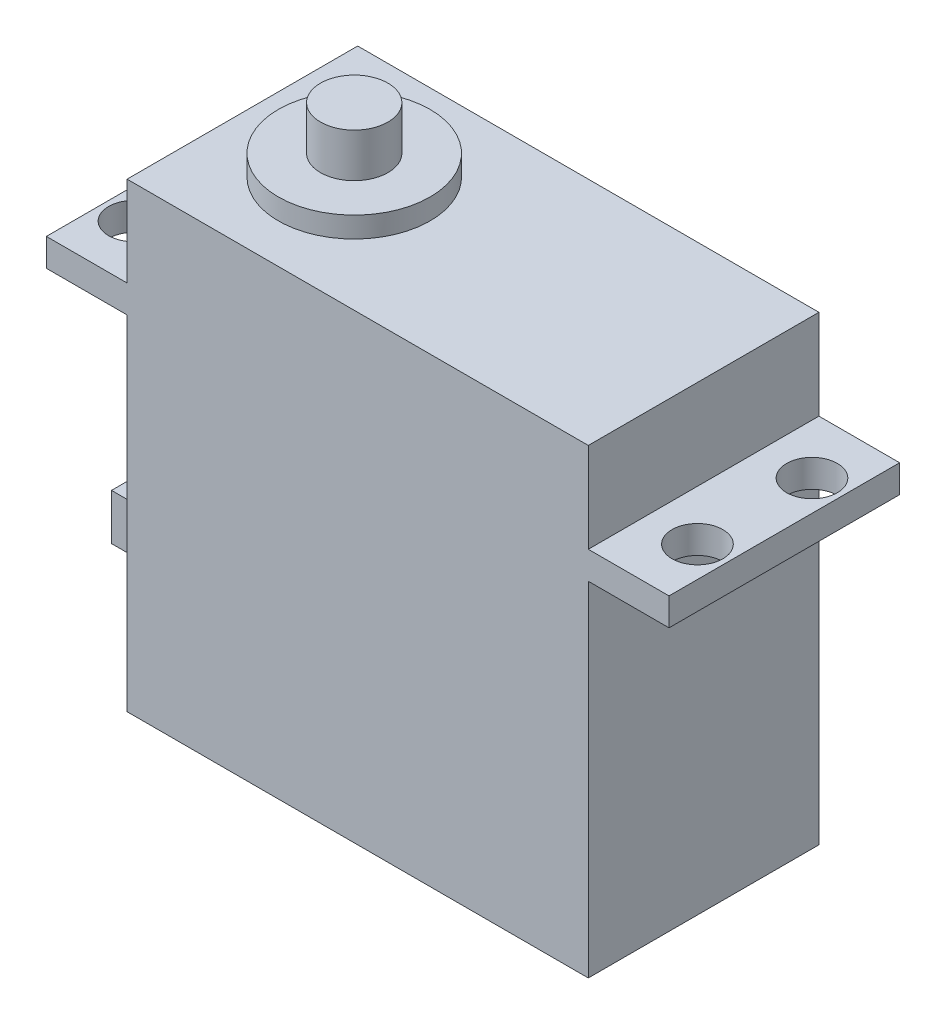
ISO-10303-21;
HEADER;
FILE_DESCRIPTION(('STEP AP214'),'2;1');
FILE_NAME('part.step','',(''),(''),'','','');
FILE_SCHEMA(('AUTOMOTIVE_DESIGN { 1 0 10303 214 1 1 1 1 }'));
ENDSEC;
DATA;
#1=APPLICATION_CONTEXT('core data for automotive mechanical design processes');
#2=APPLICATION_PROTOCOL_DEFINITION('international standard','automotive_design',2000,#1);
#3=PRODUCT_CONTEXT('',#1,'mechanical');
#4=PRODUCT('Part','Part','',(#3));
#5=PRODUCT_RELATED_PRODUCT_CATEGORY('part','',(#4));
#6=PRODUCT_DEFINITION_FORMATION('','',#4);
#7=PRODUCT_DEFINITION_CONTEXT('part definition',#1,'design');
#8=PRODUCT_DEFINITION('design','',#6,#7);
#9=PRODUCT_DEFINITION_SHAPE('','',#8);
#10=(LENGTH_UNIT() NAMED_UNIT(*) SI_UNIT(.MILLI.,.METRE.));
#11=(NAMED_UNIT(*) PLANE_ANGLE_UNIT() SI_UNIT($,.RADIAN.));
#12=(NAMED_UNIT(*) SI_UNIT($,.STERADIAN.) SOLID_ANGLE_UNIT());
#13=UNCERTAINTY_MEASURE_WITH_UNIT(LENGTH_MEASURE(1.E-05),#10,'distance_accuracy_value','');
#14=(GEOMETRIC_REPRESENTATION_CONTEXT(3) GLOBAL_UNCERTAINTY_ASSIGNED_CONTEXT((#13)) GLOBAL_UNIT_ASSIGNED_CONTEXT((#10,
#11,#12)) REPRESENTATION_CONTEXT('',''));
#15=CARTESIAN_POINT('',(0.,0.,0.));
#16=DIRECTION('',(0.,0.,1.));
#17=DIRECTION('',(1.,0.,0.));
#18=AXIS2_PLACEMENT_3D('',#15,#16,#17);
#19=CARTESIAN_POINT('',(-20.,-20.,20.));
#20=DIRECTION('',(1.,0.,0.));
#21=DIRECTION('',(0.,0.,-1.));
#22=AXIS2_PLACEMENT_3D('',#19,#20,#21);
#23=PLANE('',#22);
#24=DIRECTION('',(0.,-1.,0.));
#25=VECTOR('',#24,1.);
#26=CARTESIAN_POINT('',(-20.,-20.,20.));
#27=LINE('',#26,#25);
#28=CARTESIAN_POINT('',(-20.,9.8,20.));
#29=VERTEX_POINT('',#28);
#30=CARTESIAN_POINT('',(-20.,-20.,20.));
#31=VERTEX_POINT('',#30);
#32=EDGE_CURVE('E266',#29,#31,#27,.T.);
#33=ORIENTED_EDGE('',*,*,#32,.F.);
#34=DIRECTION('',(0.,0.,-1.));
#35=VECTOR('',#34,1.);
#36=CARTESIAN_POINT('',(-20.,9.8,0.));
#37=LINE('',#36,#35);
#38=CARTESIAN_POINT('',(-20.,9.8,0.));
#39=VERTEX_POINT('',#38);
#40=EDGE_CURVE('E227',#29,#39,#37,.T.);
#41=ORIENTED_EDGE('',*,*,#40,.T.);
#42=DIRECTION('',(0.,-1.,0.));
#43=VECTOR('',#42,1.);
#44=CARTESIAN_POINT('',(-20.,-20.,0.));
#45=LINE('',#44,#43);
#46=CARTESIAN_POINT('',(-20.,-20.,0.));
#47=VERTEX_POINT('',#46);
#48=EDGE_CURVE('E278',#39,#47,#45,.T.);
#49=ORIENTED_EDGE('',*,*,#48,.T.);
#50=DIRECTION('',(0.,0.,-1.));
#51=VECTOR('',#50,1.);
#52=CARTESIAN_POINT('',(-20.,-20.,20.));
#53=LINE('',#52,#51);
#54=EDGE_CURVE('E286',#31,#47,#53,.T.);
#55=ORIENTED_EDGE('',*,*,#54,.F.);
#56=EDGE_LOOP('',(#33,#41,#49,#55));
#57=FACE_BOUND('',#56,.T.);
#58=DIRECTION('',(0.,-1.,0.));
#59=VECTOR('',#58,1.);
#60=CARTESIAN_POINT('',(-20.,-15.2,7.15));
#61=LINE('',#60,#59);
#62=CARTESIAN_POINT('',(-20.,-11.2,7.15));
#63=VERTEX_POINT('',#62);
#64=CARTESIAN_POINT('',(-20.,-15.2,7.15));
#65=VERTEX_POINT('',#64);
#66=EDGE_CURVE('E169',#63,#65,#61,.T.);
#67=ORIENTED_EDGE('',*,*,#66,.F.);
#68=DIRECTION('',(0.,0.,-1.));
#69=VECTOR('',#68,1.);
#70=CARTESIAN_POINT('',(-20.,-11.2,7.15));
#71=LINE('',#70,#69);
#72=CARTESIAN_POINT('',(-20.,-11.2,12.85));
#73=VERTEX_POINT('',#72);
#74=EDGE_CURVE('E166',#73,#63,#71,.T.);
#75=ORIENTED_EDGE('',*,*,#74,.F.);
#76=DIRECTION('',(0.,1.,0.));
#77=VECTOR('',#76,1.);
#78=CARTESIAN_POINT('',(-20.,-15.2,12.85));
#79=LINE('',#78,#77);
#80=CARTESIAN_POINT('',(-20.,-15.2,12.85));
#81=VERTEX_POINT('',#80);
#82=EDGE_CURVE('E56',#81,#73,#79,.T.);
#83=ORIENTED_EDGE('',*,*,#82,.F.);
#84=DIRECTION('',(0.,0.,1.));
#85=VECTOR('',#84,1.);
#86=CARTESIAN_POINT('',(-20.,-15.2,7.15));
#87=LINE('',#86,#85);
#88=EDGE_CURVE('E51',#65,#81,#87,.T.);
#89=ORIENTED_EDGE('',*,*,#88,.F.);
#90=EDGE_LOOP('',(#67,#75,#83,#89));
#91=FACE_BOUND('',#90,.T.);
#92=ADVANCED_FACE('F35',(#57,#91),#23,.F.);
#93=CARTESIAN_POINT('',(0.,12.2,0.));
#94=DIRECTION('',(0.,-1.,0.));
#95=DIRECTION('',(0.,0.,-1.));
#96=AXIS2_PLACEMENT_3D('',#93,#94,#95);
#97=PLANE('',#96);
#98=CARTESIAN_POINT('',(-24.35,12.2,15.05));
#99=DIRECTION('',(0.,1.,0.));
#100=DIRECTION('',(0.,0.,1.));
#101=AXIS2_PLACEMENT_3D('',#98,#99,#100);
#102=CIRCLE('',#101,2.2);
#103=CARTESIAN_POINT('',(-24.35,12.2,17.25));
#104=VERTEX_POINT('',#103);
#105=EDGE_CURVE('E181',#104,#104,#102,.T.);
#106=ORIENTED_EDGE('',*,*,#105,.F.);
#107=EDGE_LOOP('',(#106));
#108=FACE_BOUND('',#107,.T.);
#109=DIRECTION('',(0.,0.,-1.));
#110=VECTOR('',#109,1.);
#111=CARTESIAN_POINT('',(-20.,12.2,0.));
#112=LINE('',#111,#110);
#113=CARTESIAN_POINT('',(-20.,12.2,20.));
#114=VERTEX_POINT('',#113);
#115=CARTESIAN_POINT('',(-20.,12.2,0.));
#116=VERTEX_POINT('',#115);
#117=EDGE_CURVE('E225',#114,#116,#112,.T.);
#118=ORIENTED_EDGE('',*,*,#117,.T.);
#119=DIRECTION('',(-1.,0.,0.));
#120=VECTOR('',#119,1.);
#121=CARTESIAN_POINT('',(-20.,12.2,0.));
#122=LINE('',#121,#120);
#123=CARTESIAN_POINT('',(-27.,12.2,0.));
#124=VERTEX_POINT('',#123);
#125=EDGE_CURVE('E243',#116,#124,#122,.T.);
#126=ORIENTED_EDGE('',*,*,#125,.T.);
#127=DIRECTION('',(0.,0.,1.));
#128=VECTOR('',#127,1.);
#129=CARTESIAN_POINT('',(-27.,12.2,0.));
#130=LINE('',#129,#128);
#131=CARTESIAN_POINT('',(-27.,12.2,20.));
#132=VERTEX_POINT('',#131);
#133=EDGE_CURVE('E246',#124,#132,#130,.T.);
#134=ORIENTED_EDGE('',*,*,#133,.T.);
#135=DIRECTION('',(1.,0.,0.));
#136=VECTOR('',#135,1.);
#137=CARTESIAN_POINT('',(-20.,12.2,20.));
#138=LINE('',#137,#136);
#139=EDGE_CURVE('E231',#132,#114,#138,.T.);
#140=ORIENTED_EDGE('',*,*,#139,.T.);
#141=EDGE_LOOP('',(#118,#126,#134,#140));
#142=FACE_BOUND('',#141,.T.);
#143=CARTESIAN_POINT('',(-24.35,12.2,4.95));
#144=DIRECTION('',(0.,1.,0.));
#145=DIRECTION('',(0.,0.,1.));
#146=AXIS2_PLACEMENT_3D('',#143,#144,#145);
#147=CIRCLE('',#146,2.2);
#148=CARTESIAN_POINT('',(-24.35,12.2,7.15));
#149=VERTEX_POINT('',#148);
#150=EDGE_CURVE('E170',#149,#149,#147,.T.);
#151=ORIENTED_EDGE('',*,*,#150,.F.);
#152=EDGE_LOOP('',(#151));
#153=FACE_BOUND('',#152,.T.);
#154=ADVANCED_FACE('F317',(#108,#142,#153),#97,.F.);
#155=CARTESIAN_POINT('',(20.,-20.,20.));
#156=DIRECTION('',(-1.,0.,0.));
#157=DIRECTION('',(0.,0.,1.));
#158=AXIS2_PLACEMENT_3D('',#155,#156,#157);
#159=PLANE('',#158);
#160=DIRECTION('',(0.,0.,1.));
#161=VECTOR('',#160,1.);
#162=CARTESIAN_POINT('',(20.,12.2,0.));
#163=LINE('',#162,#161);
#164=CARTESIAN_POINT('',(20.,12.2,0.));
#165=VERTEX_POINT('',#164);
#166=CARTESIAN_POINT('',(20.,12.2,20.));
#167=VERTEX_POINT('',#166);
#168=EDGE_CURVE('E199',#165,#167,#163,.T.);
#169=ORIENTED_EDGE('',*,*,#168,.F.);
#170=DIRECTION('',(0.,1.,0.));
#171=VECTOR('',#170,1.);
#172=CARTESIAN_POINT('',(20.,-20.,0.));
#173=LINE('',#172,#171);
#174=CARTESIAN_POINT('',(20.,20.,0.));
#175=VERTEX_POINT('',#174);
#176=EDGE_CURVE('E259',#165,#175,#173,.T.);
#177=ORIENTED_EDGE('',*,*,#176,.T.);
#178=DIRECTION('',(0.,0.,-1.));
#179=VECTOR('',#178,1.);
#180=CARTESIAN_POINT('',(20.,20.,20.));
#181=LINE('',#180,#179);
#182=CARTESIAN_POINT('',(20.,20.,20.));
#183=VERTEX_POINT('',#182);
#184=EDGE_CURVE('E291',#183,#175,#181,.T.);
#185=ORIENTED_EDGE('',*,*,#184,.F.);
#186=DIRECTION('',(0.,1.,0.));
#187=VECTOR('',#186,1.);
#188=CARTESIAN_POINT('',(20.,-20.,20.));
#189=LINE('',#188,#187);
#190=EDGE_CURVE('E264',#167,#183,#189,.T.);
#191=ORIENTED_EDGE('',*,*,#190,.F.);
#192=EDGE_LOOP('',(#169,#177,#185,#191));
#193=FACE_BOUND('',#192,.T.);
#194=ADVANCED_FACE('F325',(#193),#159,.F.);
#195=ORIENTED_EDGE('',*,*,#117,.F.);
#196=CARTESIAN_POINT('',(-20.,20.,20.));
#197=VERTEX_POINT('',#196);
#198=EDGE_CURVE('E267',#197,#114,#27,.T.);
#199=ORIENTED_EDGE('',*,*,#198,.F.);
#200=DIRECTION('',(0.,0.,-1.));
#201=VECTOR('',#200,1.);
#202=CARTESIAN_POINT('',(-20.,20.,20.));
#203=LINE('',#202,#201);
#204=CARTESIAN_POINT('',(-20.,20.,0.));
#205=VERTEX_POINT('',#204);
#206=EDGE_CURVE('E289',#197,#205,#203,.T.);
#207=ORIENTED_EDGE('',*,*,#206,.T.);
#208=EDGE_CURVE('E279',#205,#116,#45,.T.);
#209=ORIENTED_EDGE('',*,*,#208,.T.);
#210=EDGE_LOOP('',(#195,#199,#207,#209));
#211=FACE_BOUND('',#210,.T.);
#212=ADVANCED_FACE('F312',(#211),#23,.F.);
#213=CARTESIAN_POINT('',(20.,-20.,0.));
#214=VERTEX_POINT('',#213);
#215=CARTESIAN_POINT('',(20.,9.8,0.));
#216=VERTEX_POINT('',#215);
#217=EDGE_CURVE('E273',#214,#216,#173,.T.);
#218=ORIENTED_EDGE('',*,*,#217,.T.);
#219=DIRECTION('',(0.,0.,1.));
#220=VECTOR('',#219,1.);
#221=CARTESIAN_POINT('',(20.,9.8,0.));
#222=LINE('',#221,#220);
#223=CARTESIAN_POINT('',(20.,9.8,20.));
#224=VERTEX_POINT('',#223);
#225=EDGE_CURVE('E200',#216,#224,#222,.T.);
#226=ORIENTED_EDGE('',*,*,#225,.T.);
#227=CARTESIAN_POINT('',(20.,-20.,20.));
#228=VERTEX_POINT('',#227);
#229=EDGE_CURVE('E260',#228,#224,#189,.T.);
#230=ORIENTED_EDGE('',*,*,#229,.F.);
#231=DIRECTION('',(0.,0.,-1.));
#232=VECTOR('',#231,1.);
#233=CARTESIAN_POINT('',(20.,-20.,20.));
#234=LINE('',#233,#232);
#235=EDGE_CURVE('E272',#228,#214,#234,.T.);
#236=ORIENTED_EDGE('',*,*,#235,.T.);
#237=EDGE_LOOP('',(#218,#226,#230,#236));
#238=FACE_BOUND('',#237,.T.);
#239=ADVANCED_FACE('F37',(#238),#159,.F.);
#240=CARTESIAN_POINT('',(-20.,20.,20.));
#241=DIRECTION('',(0.,-1.,0.));
#242=DIRECTION('',(0.,0.,-1.));
#243=AXIS2_PLACEMENT_3D('',#240,#241,#242);
#244=PLANE('',#243);
#245=CARTESIAN_POINT('',(-10.3,20.,10.));
#246=DIRECTION('',(0.,-1.,0.));
#247=DIRECTION('',(0.,0.,-1.));
#248=AXIS2_PLACEMENT_3D('',#245,#246,#247);
#249=CIRCLE('',#248,6.58);
#250=CARTESIAN_POINT('',(-10.3,20.,3.42));
#251=VERTEX_POINT('',#250);
#252=EDGE_CURVE('E39',#251,#251,#249,.F.);
#253=ORIENTED_EDGE('',*,*,#252,.F.);
#254=EDGE_LOOP('',(#253));
#255=FACE_BOUND('',#254,.T.);
#256=DIRECTION('',(-1.,0.,0.));
#257=VECTOR('',#256,1.);
#258=CARTESIAN_POINT('',(-20.,20.,0.));
#259=LINE('',#258,#257);
#260=EDGE_CURVE('E276',#175,#205,#259,.T.);
#261=ORIENTED_EDGE('',*,*,#260,.T.);
#262=ORIENTED_EDGE('',*,*,#206,.F.);
#263=DIRECTION('',(-1.,0.,0.));
#264=VECTOR('',#263,1.);
#265=CARTESIAN_POINT('',(-20.,20.,20.));
#266=LINE('',#265,#264);
#267=EDGE_CURVE('E263',#183,#197,#266,.T.);
#268=ORIENTED_EDGE('',*,*,#267,.F.);
#269=ORIENTED_EDGE('',*,*,#184,.T.);
#270=EDGE_LOOP('',(#261,#262,#268,#269));
#271=FACE_BOUND('',#270,.T.);
#272=ADVANCED_FACE('F301',(#255,#271),#244,.F.);
#273=CARTESIAN_POINT('',(-20.,-20.,20.));
#274=DIRECTION('',(0.,1.,0.));
#275=DIRECTION('',(0.,0.,1.));
#276=AXIS2_PLACEMENT_3D('',#273,#274,#275);
#277=PLANE('',#276);
#278=DIRECTION('',(1.,0.,0.));
#279=VECTOR('',#278,1.);
#280=CARTESIAN_POINT('',(-20.,-20.,0.));
#281=LINE('',#280,#279);
#282=EDGE_CURVE('E282',#47,#214,#281,.T.);
#283=ORIENTED_EDGE('',*,*,#282,.T.);
#284=ORIENTED_EDGE('',*,*,#235,.F.);
#285=DIRECTION('',(1.,0.,0.));
#286=VECTOR('',#285,1.);
#287=CARTESIAN_POINT('',(-20.,-20.,20.));
#288=LINE('',#287,#286);
#289=EDGE_CURVE('E270',#31,#228,#288,.T.);
#290=ORIENTED_EDGE('',*,*,#289,.F.);
#291=ORIENTED_EDGE('',*,*,#54,.T.);
#292=EDGE_LOOP('',(#283,#284,#290,#291));
#293=FACE_BOUND('',#292,.T.);
#294=ADVANCED_FACE('F303',(#293),#277,.F.);
#295=CARTESIAN_POINT('',(0.,0.,20.));
#296=DIRECTION('',(0.,0.,-1.));
#297=DIRECTION('',(-1.,0.,0.));
#298=AXIS2_PLACEMENT_3D('',#295,#296,#297);
#299=PLANE('',#298);
#300=ORIENTED_EDGE('',*,*,#229,.T.);
#301=DIRECTION('',(1.,0.,0.));
#302=VECTOR('',#301,1.);
#303=CARTESIAN_POINT('',(20.,9.8,20.));
#304=LINE('',#303,#302);
#305=CARTESIAN_POINT('',(27.,9.8,20.));
#306=VERTEX_POINT('',#305);
#307=EDGE_CURVE('E203',#224,#306,#304,.T.);
#308=ORIENTED_EDGE('',*,*,#307,.T.);
#309=DIRECTION('',(0.,1.,0.));
#310=VECTOR('',#309,1.);
#311=CARTESIAN_POINT('',(27.,9.8,20.));
#312=LINE('',#311,#310);
#313=CARTESIAN_POINT('',(27.,12.2,20.));
#314=VERTEX_POINT('',#313);
#315=EDGE_CURVE('E213',#306,#314,#312,.T.);
#316=ORIENTED_EDGE('',*,*,#315,.T.);
#317=DIRECTION('',(1.,0.,0.));
#318=VECTOR('',#317,1.);
#319=CARTESIAN_POINT('',(20.,12.2,20.));
#320=LINE('',#319,#318);
#321=EDGE_CURVE('E216',#167,#314,#320,.T.);
#322=ORIENTED_EDGE('',*,*,#321,.F.);
#323=ORIENTED_EDGE('',*,*,#190,.T.);
#324=ORIENTED_EDGE('',*,*,#267,.T.);
#325=ORIENTED_EDGE('',*,*,#198,.T.);
#326=ORIENTED_EDGE('',*,*,#139,.F.);
#327=DIRECTION('',(0.,1.,0.));
#328=VECTOR('',#327,1.);
#329=CARTESIAN_POINT('',(-27.,9.8,20.));
#330=LINE('',#329,#328);
#331=CARTESIAN_POINT('',(-27.,9.8,20.));
#332=VERTEX_POINT('',#331);
#333=EDGE_CURVE('E250',#332,#132,#330,.T.);
#334=ORIENTED_EDGE('',*,*,#333,.F.);
#335=DIRECTION('',(1.,0.,0.));
#336=VECTOR('',#335,1.);
#337=CARTESIAN_POINT('',(-20.,9.8,20.));
#338=LINE('',#337,#336);
#339=EDGE_CURVE('E237',#332,#29,#338,.T.);
#340=ORIENTED_EDGE('',*,*,#339,.T.);
#341=ORIENTED_EDGE('',*,*,#32,.T.);
#342=ORIENTED_EDGE('',*,*,#289,.T.);
#343=EDGE_LOOP('',(#300,#308,#316,#322,#323,#324,#325,#326,#334,#340,#341,#342));
#344=FACE_BOUND('',#343,.T.);
#345=ADVANCED_FACE('F321',(#344),#299,.F.);
#346=CARTESIAN_POINT('',(0.,0.,0.));
#347=DIRECTION('',(0.,0.,-1.));
#348=DIRECTION('',(-1.,0.,0.));
#349=AXIS2_PLACEMENT_3D('',#346,#347,#348);
#350=PLANE('',#349);
#351=ORIENTED_EDGE('',*,*,#217,.F.);
#352=ORIENTED_EDGE('',*,*,#282,.F.);
#353=ORIENTED_EDGE('',*,*,#48,.F.);
#354=DIRECTION('',(-1.,0.,0.));
#355=VECTOR('',#354,1.);
#356=CARTESIAN_POINT('',(-20.,9.8,0.));
#357=LINE('',#356,#355);
#358=CARTESIAN_POINT('',(-27.,9.8,0.));
#359=VERTEX_POINT('',#358);
#360=EDGE_CURVE('E230',#39,#359,#357,.T.);
#361=ORIENTED_EDGE('',*,*,#360,.T.);
#362=DIRECTION('',(0.,1.,0.));
#363=VECTOR('',#362,1.);
#364=CARTESIAN_POINT('',(-27.,9.8,0.));
#365=LINE('',#364,#363);
#366=EDGE_CURVE('E240',#359,#124,#365,.T.);
#367=ORIENTED_EDGE('',*,*,#366,.T.);
#368=ORIENTED_EDGE('',*,*,#125,.F.);
#369=ORIENTED_EDGE('',*,*,#208,.F.);
#370=ORIENTED_EDGE('',*,*,#260,.F.);
#371=ORIENTED_EDGE('',*,*,#176,.F.);
#372=DIRECTION('',(-1.,0.,0.));
#373=VECTOR('',#372,1.);
#374=CARTESIAN_POINT('',(20.,12.2,0.));
#375=LINE('',#374,#373);
#376=CARTESIAN_POINT('',(27.,12.2,0.));
#377=VERTEX_POINT('',#376);
#378=EDGE_CURVE('E204',#377,#165,#375,.T.);
#379=ORIENTED_EDGE('',*,*,#378,.F.);
#380=DIRECTION('',(0.,1.,0.));
#381=VECTOR('',#380,1.);
#382=CARTESIAN_POINT('',(27.,9.8,0.));
#383=LINE('',#382,#381);
#384=CARTESIAN_POINT('',(27.,9.8,0.));
#385=VERTEX_POINT('',#384);
#386=EDGE_CURVE('E223',#385,#377,#383,.T.);
#387=ORIENTED_EDGE('',*,*,#386,.F.);
#388=DIRECTION('',(-1.,0.,0.));
#389=VECTOR('',#388,1.);
#390=CARTESIAN_POINT('',(20.,9.8,0.));
#391=LINE('',#390,#389);
#392=EDGE_CURVE('E210',#385,#216,#391,.T.);
#393=ORIENTED_EDGE('',*,*,#392,.T.);
#394=EDGE_LOOP('',(#351,#352,#353,#361,#367,#368,#369,#370,#371,#379,#387,#393));
#395=FACE_BOUND('',#394,.T.);
#396=ADVANCED_FACE('F314',(#395),#350,.T.);
#397=CARTESIAN_POINT('',(-10.3,21.8,10.));
#398=DIRECTION('',(0.,-1.,0.));
#399=DIRECTION('',(0.,0.,-1.));
#400=AXIS2_PLACEMENT_3D('',#397,#398,#399);
#401=CYLINDRICAL_SURFACE('',#400,6.58);
#402=CARTESIAN_POINT('',(-10.3,21.8,10.));
#403=DIRECTION('',(0.,1.,0.));
#404=DIRECTION('',(0.,0.,1.));
#405=AXIS2_PLACEMENT_3D('',#402,#403,#404);
#406=CIRCLE('',#405,6.58);
#407=CARTESIAN_POINT('',(-10.3,21.8,16.58));
#408=VERTEX_POINT('',#407);
#409=EDGE_CURVE('E255',#408,#408,#406,.T.);
#410=ORIENTED_EDGE('',*,*,#409,.F.);
#411=EDGE_LOOP('',(#410));
#412=FACE_BOUND('',#411,.T.);
#413=ORIENTED_EDGE('',*,*,#252,.T.);
#414=EDGE_LOOP('',(#413));
#415=FACE_BOUND('',#414,.T.);
#416=ADVANCED_FACE('F299',(#412,#415),#401,.T.);
#417=CARTESIAN_POINT('',(-10.3,21.8,10.));
#418=DIRECTION('',(0.,1.,0.));
#419=DIRECTION('',(0.,0.,1.));
#420=AXIS2_PLACEMENT_3D('',#417,#418,#419);
#421=PLANE('',#420);
#422=CARTESIAN_POINT('',(-10.3,21.8,10.));
#423=DIRECTION('',(0.,1.,0.));
#424=DIRECTION('',(0.,0.,1.));
#425=AXIS2_PLACEMENT_3D('',#422,#423,#424);
#426=CIRCLE('',#425,2.925);
#427=CARTESIAN_POINT('',(-10.3,21.8,12.925));
#428=VERTEX_POINT('',#427);
#429=EDGE_CURVE('E11',#428,#428,#426,.T.);
#430=ORIENTED_EDGE('',*,*,#429,.F.);
#431=EDGE_LOOP('',(#430));
#432=FACE_BOUND('',#431,.T.);
#433=ORIENTED_EDGE('',*,*,#409,.T.);
#434=EDGE_LOOP('',(#433));
#435=FACE_BOUND('',#434,.T.);
#436=ADVANCED_FACE('F594',(#432,#435),#421,.T.);
#437=CARTESIAN_POINT('',(-10.3,25.6,10.));
#438=DIRECTION('',(0.,-1.,0.));
#439=DIRECTION('',(0.,0.,-1.));
#440=AXIS2_PLACEMENT_3D('',#437,#438,#439);
#441=CYLINDRICAL_SURFACE('',#440,2.925);
#442=CARTESIAN_POINT('',(-10.3,25.6,10.));
#443=DIRECTION('',(0.,1.,0.));
#444=DIRECTION('',(0.,0.,1.));
#445=AXIS2_PLACEMENT_3D('',#442,#443,#444);
#446=CIRCLE('',#445,2.925);
#447=CARTESIAN_POINT('',(-10.3,25.6,12.925));
#448=VERTEX_POINT('',#447);
#449=EDGE_CURVE('E252',#448,#448,#446,.T.);
#450=ORIENTED_EDGE('',*,*,#449,.F.);
#451=EDGE_LOOP('',(#450));
#452=FACE_BOUND('',#451,.T.);
#453=ORIENTED_EDGE('',*,*,#429,.T.);
#454=EDGE_LOOP('',(#453));
#455=FACE_BOUND('',#454,.T.);
#456=ADVANCED_FACE('F361',(#452,#455),#441,.T.);
#457=CARTESIAN_POINT('',(-10.3,25.6,10.));
#458=DIRECTION('',(0.,1.,0.));
#459=DIRECTION('',(0.,0.,1.));
#460=AXIS2_PLACEMENT_3D('',#457,#458,#459);
#461=PLANE('',#460);
#462=ORIENTED_EDGE('',*,*,#449,.T.);
#463=EDGE_LOOP('',(#462));
#464=FACE_BOUND('',#463,.T.);
#465=ADVANCED_FACE('F353',(#464),#461,.T.);
#466=CARTESIAN_POINT('',(-27.,9.8,0.));
#467=DIRECTION('',(-1.,0.,0.));
#468=DIRECTION('',(0.,0.,1.));
#469=AXIS2_PLACEMENT_3D('',#466,#467,#468);
#470=PLANE('',#469);
#471=ORIENTED_EDGE('',*,*,#133,.F.);
#472=ORIENTED_EDGE('',*,*,#366,.F.);
#473=DIRECTION('',(0.,0.,1.));
#474=VECTOR('',#473,1.);
#475=CARTESIAN_POINT('',(-27.,9.8,0.));
#476=LINE('',#475,#474);
#477=EDGE_CURVE('E234',#359,#332,#476,.T.);
#478=ORIENTED_EDGE('',*,*,#477,.T.);
#479=ORIENTED_EDGE('',*,*,#333,.T.);
#480=EDGE_LOOP('',(#471,#472,#478,#479));
#481=FACE_BOUND('',#480,.T.);
#482=ADVANCED_FACE('F351',(#481),#470,.T.);
#483=CARTESIAN_POINT('',(0.,9.8,0.));
#484=DIRECTION('',(0.,-1.,0.));
#485=DIRECTION('',(0.,0.,-1.));
#486=AXIS2_PLACEMENT_3D('',#483,#484,#485);
#487=PLANE('',#486);
#488=CARTESIAN_POINT('',(-24.35,9.8,4.95));
#489=DIRECTION('',(0.,-1.,0.));
#490=DIRECTION('',(0.,0.,-1.));
#491=AXIS2_PLACEMENT_3D('',#488,#489,#490);
#492=CIRCLE('',#491,2.2);
#493=CARTESIAN_POINT('',(-24.35,9.8,2.75));
#494=VERTEX_POINT('',#493);
#495=EDGE_CURVE('E173',#494,#494,#492,.T.);
#496=ORIENTED_EDGE('',*,*,#495,.F.);
#497=EDGE_LOOP('',(#496));
#498=FACE_BOUND('',#497,.T.);
#499=CARTESIAN_POINT('',(-24.35,9.8,15.05));
#500=DIRECTION('',(0.,-1.,0.));
#501=DIRECTION('',(0.,0.,-1.));
#502=AXIS2_PLACEMENT_3D('',#499,#500,#501);
#503=CIRCLE('',#502,2.2);
#504=CARTESIAN_POINT('',(-24.35,9.8,12.85));
#505=VERTEX_POINT('',#504);
#506=EDGE_CURVE('E184',#505,#505,#503,.T.);
#507=ORIENTED_EDGE('',*,*,#506,.F.);
#508=EDGE_LOOP('',(#507));
#509=FACE_BOUND('',#508,.T.);
#510=ORIENTED_EDGE('',*,*,#40,.F.);
#511=ORIENTED_EDGE('',*,*,#339,.F.);
#512=ORIENTED_EDGE('',*,*,#477,.F.);
#513=ORIENTED_EDGE('',*,*,#360,.F.);
#514=EDGE_LOOP('',(#510,#511,#512,#513));
#515=FACE_BOUND('',#514,.T.);
#516=ADVANCED_FACE('F348',(#498,#509,#515),#487,.T.);
#517=CARTESIAN_POINT('',(27.,9.8,0.));
#518=DIRECTION('',(1.,0.,0.));
#519=DIRECTION('',(0.,0.,-1.));
#520=AXIS2_PLACEMENT_3D('',#517,#518,#519);
#521=PLANE('',#520);
#522=DIRECTION('',(0.,0.,-1.));
#523=VECTOR('',#522,1.);
#524=CARTESIAN_POINT('',(27.,12.2,0.));
#525=LINE('',#524,#523);
#526=EDGE_CURVE('E219',#314,#377,#525,.T.);
#527=ORIENTED_EDGE('',*,*,#526,.F.);
#528=ORIENTED_EDGE('',*,*,#315,.F.);
#529=DIRECTION('',(0.,0.,-1.));
#530=VECTOR('',#529,1.);
#531=CARTESIAN_POINT('',(27.,9.8,0.));
#532=LINE('',#531,#530);
#533=EDGE_CURVE('E207',#306,#385,#532,.T.);
#534=ORIENTED_EDGE('',*,*,#533,.T.);
#535=ORIENTED_EDGE('',*,*,#386,.T.);
#536=EDGE_LOOP('',(#527,#528,#534,#535));
#537=FACE_BOUND('',#536,.T.);
#538=ADVANCED_FACE('F331',(#537),#521,.T.);
#539=CARTESIAN_POINT('',(0.,9.8,0.));
#540=DIRECTION('',(0.,1.,0.));
#541=DIRECTION('',(0.,0.,1.));
#542=AXIS2_PLACEMENT_3D('',#539,#540,#541);
#543=PLANE('',#542);
#544=CARTESIAN_POINT('',(24.35,9.8,4.94999999999999));
#545=DIRECTION('',(0.,1.,0.));
#546=DIRECTION('',(0.,0.,1.));
#547=AXIS2_PLACEMENT_3D('',#544,#545,#546);
#548=CIRCLE('',#547,2.2);
#549=CARTESIAN_POINT('',(24.35,9.8,7.14999999999999));
#550=VERTEX_POINT('',#549);
#551=EDGE_CURVE('E190',#550,#550,#548,.T.);
#552=ORIENTED_EDGE('',*,*,#551,.T.);
#553=EDGE_LOOP('',(#552));
#554=FACE_BOUND('',#553,.T.);
#555=CARTESIAN_POINT('',(24.35,9.8,14.883974448793));
#556=DIRECTION('',(0.,1.,0.));
#557=DIRECTION('',(0.,0.,1.));
#558=AXIS2_PLACEMENT_3D('',#555,#556,#557);
#559=CIRCLE('',#558,2.2);
#560=CARTESIAN_POINT('',(24.35,9.8,17.083974448793));
#561=VERTEX_POINT('',#560);
#562=EDGE_CURVE('E196',#561,#561,#559,.T.);
#563=ORIENTED_EDGE('',*,*,#562,.T.);
#564=EDGE_LOOP('',(#563));
#565=FACE_BOUND('',#564,.T.);
#566=ORIENTED_EDGE('',*,*,#225,.F.);
#567=ORIENTED_EDGE('',*,*,#392,.F.);
#568=ORIENTED_EDGE('',*,*,#533,.F.);
#569=ORIENTED_EDGE('',*,*,#307,.F.);
#570=EDGE_LOOP('',(#566,#567,#568,#569));
#571=FACE_BOUND('',#570,.T.);
#572=ADVANCED_FACE('F335',(#554,#565,#571),#543,.F.);
#573=CARTESIAN_POINT('',(0.,12.2,0.));
#574=DIRECTION('',(0.,1.,0.));
#575=DIRECTION('',(0.,0.,1.));
#576=AXIS2_PLACEMENT_3D('',#573,#574,#575);
#577=PLANE('',#576);
#578=CARTESIAN_POINT('',(24.35,12.2,4.94999999999999));
#579=DIRECTION('',(0.,1.,0.));
#580=DIRECTION('',(0.,0.,1.));
#581=AXIS2_PLACEMENT_3D('',#578,#579,#580);
#582=CIRCLE('',#581,2.2);
#583=CARTESIAN_POINT('',(24.35,12.2,7.14999999999999));
#584=VERTEX_POINT('',#583);
#585=EDGE_CURVE('E187',#584,#584,#582,.T.);
#586=ORIENTED_EDGE('',*,*,#585,.F.);
#587=EDGE_LOOP('',(#586));
#588=FACE_BOUND('',#587,.T.);
#589=CARTESIAN_POINT('',(24.35,12.2,14.883974448793));
#590=DIRECTION('',(0.,1.,0.));
#591=DIRECTION('',(0.,0.,1.));
#592=AXIS2_PLACEMENT_3D('',#589,#590,#591);
#593=CIRCLE('',#592,2.2);
#594=CARTESIAN_POINT('',(24.35,12.2,17.083974448793));
#595=VERTEX_POINT('',#594);
#596=EDGE_CURVE('E193',#595,#595,#593,.T.);
#597=ORIENTED_EDGE('',*,*,#596,.F.);
#598=EDGE_LOOP('',(#597));
#599=FACE_BOUND('',#598,.T.);
#600=ORIENTED_EDGE('',*,*,#168,.T.);
#601=ORIENTED_EDGE('',*,*,#321,.T.);
#602=ORIENTED_EDGE('',*,*,#526,.T.);
#603=ORIENTED_EDGE('',*,*,#378,.T.);
#604=EDGE_LOOP('',(#600,#601,#602,#603));
#605=FACE_BOUND('',#604,.T.);
#606=ADVANCED_FACE('F328',(#588,#599,#605),#577,.T.);
#607=CARTESIAN_POINT('',(24.35,12.2,14.883974448793));
#608=DIRECTION('',(0.,1.,0.));
#609=DIRECTION('',(0.,0.,1.));
#610=AXIS2_PLACEMENT_3D('',#607,#608,#609);
#611=CYLINDRICAL_SURFACE('',#610,2.2);
#612=ORIENTED_EDGE('',*,*,#596,.T.);
#613=EDGE_LOOP('',(#612));
#614=FACE_BOUND('',#613,.T.);
#615=ORIENTED_EDGE('',*,*,#562,.F.);
#616=EDGE_LOOP('',(#615));
#617=FACE_BOUND('',#616,.T.);
#618=ADVANCED_FACE('F416',(#614,#617),#611,.F.);
#619=CARTESIAN_POINT('',(24.35,12.2,4.94999999999999));
#620=DIRECTION('',(0.,1.,0.));
#621=DIRECTION('',(0.,0.,1.));
#622=AXIS2_PLACEMENT_3D('',#619,#620,#621);
#623=CYLINDRICAL_SURFACE('',#622,2.2);
#624=ORIENTED_EDGE('',*,*,#585,.T.);
#625=EDGE_LOOP('',(#624));
#626=FACE_BOUND('',#625,.T.);
#627=ORIENTED_EDGE('',*,*,#551,.F.);
#628=EDGE_LOOP('',(#627));
#629=FACE_BOUND('',#628,.T.);
#630=ADVANCED_FACE('F425',(#626,#629),#623,.F.);
#631=CARTESIAN_POINT('',(-24.35,12.2,15.05));
#632=DIRECTION('',(0.,1.,0.));
#633=DIRECTION('',(0.,0.,1.));
#634=AXIS2_PLACEMENT_3D('',#631,#632,#633);
#635=CYLINDRICAL_SURFACE('',#634,2.2);
#636=ORIENTED_EDGE('',*,*,#506,.T.);
#637=EDGE_LOOP('',(#636));
#638=FACE_BOUND('',#637,.T.);
#639=ORIENTED_EDGE('',*,*,#105,.T.);
#640=EDGE_LOOP('',(#639));
#641=FACE_BOUND('',#640,.T.);
#642=ADVANCED_FACE('F435',(#638,#641),#635,.F.);
#643=CARTESIAN_POINT('',(-24.35,12.2,4.95));
#644=DIRECTION('',(0.,1.,0.));
#645=DIRECTION('',(0.,0.,1.));
#646=AXIS2_PLACEMENT_3D('',#643,#644,#645);
#647=CYLINDRICAL_SURFACE('',#646,2.2);
#648=ORIENTED_EDGE('',*,*,#495,.T.);
#649=EDGE_LOOP('',(#648));
#650=FACE_BOUND('',#649,.T.);
#651=ORIENTED_EDGE('',*,*,#150,.T.);
#652=EDGE_LOOP('',(#651));
#653=FACE_BOUND('',#652,.T.);
#654=ADVANCED_FACE('F444',(#650,#653),#647,.F.);
#655=CARTESIAN_POINT('',(-28.5,-15.2,7.15));
#656=DIRECTION('',(0.,0.,1.));
#657=DIRECTION('',(1.,0.,0.));
#658=AXIS2_PLACEMENT_3D('',#655,#656,#657);
#659=PLANE('',#658);
#660=ORIENTED_EDGE('',*,*,#66,.T.);
#661=DIRECTION('',(1.,0.,0.));
#662=VECTOR('',#661,1.);
#663=CARTESIAN_POINT('',(-28.5,-15.2,7.15));
#664=LINE('',#663,#662);
#665=CARTESIAN_POINT('',(-28.5,-15.2,7.15));
#666=VERTEX_POINT('',#665);
#667=EDGE_CURVE('E150',#666,#65,#664,.T.);
#668=ORIENTED_EDGE('',*,*,#667,.F.);
#669=DIRECTION('',(0.,-1.,0.));
#670=VECTOR('',#669,1.);
#671=CARTESIAN_POINT('',(-28.5,-15.2,7.15));
#672=LINE('',#671,#670);
#673=CARTESIAN_POINT('',(-28.5,-11.2,7.15));
#674=VERTEX_POINT('',#673);
#675=EDGE_CURVE('E157',#674,#666,#672,.T.);
#676=ORIENTED_EDGE('',*,*,#675,.F.);
#677=DIRECTION('',(1.,0.,0.));
#678=VECTOR('',#677,1.);
#679=CARTESIAN_POINT('',(-28.5,-11.2,7.15));
#680=LINE('',#679,#678);
#681=EDGE_CURVE('E509',#674,#63,#680,.T.);
#682=ORIENTED_EDGE('',*,*,#681,.T.);
#683=EDGE_LOOP('',(#660,#668,#676,#682));
#684=FACE_BOUND('',#683,.T.);
#685=ADVANCED_FACE('F168',(#684),#659,.F.);
#686=CARTESIAN_POINT('',(-28.5,-15.2,7.15));
#687=DIRECTION('',(0.,1.,0.));
#688=DIRECTION('',(0.,0.,1.));
#689=AXIS2_PLACEMENT_3D('',#686,#687,#688);
#690=PLANE('',#689);
#691=ORIENTED_EDGE('',*,*,#88,.T.);
#692=DIRECTION('',(1.,0.,0.));
#693=VECTOR('',#692,1.);
#694=CARTESIAN_POINT('',(-28.5,-15.2,12.85));
#695=LINE('',#694,#693);
#696=CARTESIAN_POINT('',(-28.5,-15.2,12.85));
#697=VERTEX_POINT('',#696);
#698=EDGE_CURVE('E153',#697,#81,#695,.T.);
#699=ORIENTED_EDGE('',*,*,#698,.F.);
#700=DIRECTION('',(0.,0.,1.));
#701=VECTOR('',#700,1.);
#702=CARTESIAN_POINT('',(-28.5,-15.2,7.15));
#703=LINE('',#702,#701);
#704=EDGE_CURVE('E146',#666,#697,#703,.T.);
#705=ORIENTED_EDGE('',*,*,#704,.F.);
#706=ORIENTED_EDGE('',*,*,#667,.T.);
#707=EDGE_LOOP('',(#691,#699,#705,#706));
#708=FACE_BOUND('',#707,.T.);
#709=ADVANCED_FACE('F148',(#708),#690,.F.);
#710=CARTESIAN_POINT('',(-28.5,-15.2,12.85));
#711=DIRECTION('',(0.,0.,-1.));
#712=DIRECTION('',(-1.,0.,0.));
#713=AXIS2_PLACEMENT_3D('',#710,#711,#712);
#714=PLANE('',#713);
#715=ORIENTED_EDGE('',*,*,#82,.T.);
#716=DIRECTION('',(1.,0.,0.));
#717=VECTOR('',#716,1.);
#718=CARTESIAN_POINT('',(-28.5,-11.2,12.85));
#719=LINE('',#718,#717);
#720=CARTESIAN_POINT('',(-28.5,-11.2,12.85));
#721=VERTEX_POINT('',#720);
#722=EDGE_CURVE('E175',#721,#73,#719,.T.);
#723=ORIENTED_EDGE('',*,*,#722,.F.);
#724=DIRECTION('',(0.,1.,0.));
#725=VECTOR('',#724,1.);
#726=CARTESIAN_POINT('',(-28.5,-15.2,12.85));
#727=LINE('',#726,#725);
#728=EDGE_CURVE('E156',#697,#721,#727,.T.);
#729=ORIENTED_EDGE('',*,*,#728,.F.);
#730=ORIENTED_EDGE('',*,*,#698,.T.);
#731=EDGE_LOOP('',(#715,#723,#729,#730));
#732=FACE_BOUND('',#731,.T.);
#733=ADVANCED_FACE('F471',(#732),#714,.F.);
#734=CARTESIAN_POINT('',(-28.5,-11.2,7.15));
#735=DIRECTION('',(0.,-1.,0.));
#736=DIRECTION('',(0.,0.,-1.));
#737=AXIS2_PLACEMENT_3D('',#734,#735,#736);
#738=PLANE('',#737);
#739=ORIENTED_EDGE('',*,*,#74,.T.);
#740=ORIENTED_EDGE('',*,*,#681,.F.);
#741=DIRECTION('',(0.,0.,-1.));
#742=VECTOR('',#741,1.);
#743=CARTESIAN_POINT('',(-28.5,-11.2,7.15));
#744=LINE('',#743,#742);
#745=EDGE_CURVE('E162',#721,#674,#744,.T.);
#746=ORIENTED_EDGE('',*,*,#745,.F.);
#747=ORIENTED_EDGE('',*,*,#722,.T.);
#748=EDGE_LOOP('',(#739,#740,#746,#747));
#749=FACE_BOUND('',#748,.T.);
#750=ADVANCED_FACE('F478',(#749),#738,.F.);
#751=CARTESIAN_POINT('',(-28.5,0.,0.));
#752=DIRECTION('',(1.,0.,0.));
#753=DIRECTION('',(0.,0.,-1.));
#754=AXIS2_PLACEMENT_3D('',#751,#752,#753);
#755=PLANE('',#754);
#756=ORIENTED_EDGE('',*,*,#675,.T.);
#757=ORIENTED_EDGE('',*,*,#704,.T.);
#758=ORIENTED_EDGE('',*,*,#728,.T.);
#759=ORIENTED_EDGE('',*,*,#745,.T.);
#760=EDGE_LOOP('',(#756,#757,#758,#759));
#761=FACE_BOUND('',#760,.T.);
#762=ADVANCED_FACE('F160',(#761),#755,.F.);
#763=CLOSED_SHELL('',(#92,#154,#194,#212,#239,#272,#294,#345,#396,#416,#436,#456,#465,#482,#516,
#538,#572,#606,#618,#630,#642,#654,#685,#709,#733,#750,#762));
#764=MANIFOLD_SOLID_BREP('B2',#763);
#765=ADVANCED_BREP_SHAPE_REPRESENTATION('',(#18,#764),#14);
#766=SHAPE_DEFINITION_REPRESENTATION(#9,#765);
ENDSEC;
END-ISO-10303-21;
